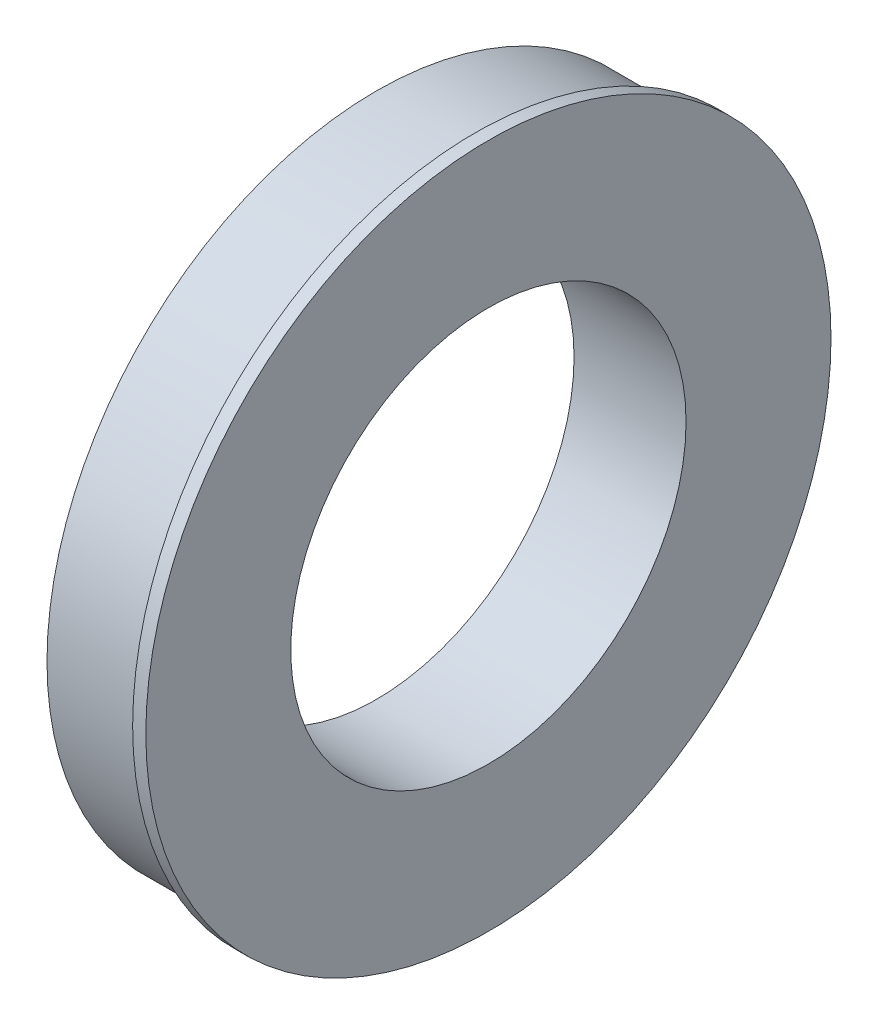
ISO-10303-21;
HEADER;
FILE_DESCRIPTION(('STEP AP214'),'2;1');
FILE_NAME('part.step','',(''),(''),'','','');
FILE_SCHEMA(('AUTOMOTIVE_DESIGN { 1 0 10303 214 1 1 1 1 }'));
ENDSEC;
DATA;
#1=APPLICATION_CONTEXT('core data for automotive mechanical design processes');
#2=APPLICATION_PROTOCOL_DEFINITION('international standard','automotive_design',2000,#1);
#3=PRODUCT_CONTEXT('',#1,'mechanical');
#4=PRODUCT('Part','Part','',(#3));
#5=PRODUCT_RELATED_PRODUCT_CATEGORY('part','',(#4));
#6=PRODUCT_DEFINITION_FORMATION('','',#4);
#7=PRODUCT_DEFINITION_CONTEXT('part definition',#1,'design');
#8=PRODUCT_DEFINITION('design','',#6,#7);
#9=PRODUCT_DEFINITION_SHAPE('','',#8);
#10=(LENGTH_UNIT() NAMED_UNIT(*) SI_UNIT(.MILLI.,.METRE.));
#11=(NAMED_UNIT(*) PLANE_ANGLE_UNIT() SI_UNIT($,.RADIAN.));
#12=(NAMED_UNIT(*) SI_UNIT($,.STERADIAN.) SOLID_ANGLE_UNIT());
#13=UNCERTAINTY_MEASURE_WITH_UNIT(LENGTH_MEASURE(1.E-05),#10,'distance_accuracy_value','');
#14=(GEOMETRIC_REPRESENTATION_CONTEXT(3) GLOBAL_UNCERTAINTY_ASSIGNED_CONTEXT((#13)) GLOBAL_UNIT_ASSIGNED_CONTEXT((#10,
#11,#12)) REPRESENTATION_CONTEXT('',''));
#15=CARTESIAN_POINT('',(0.,0.,0.));
#16=DIRECTION('',(0.,0.,1.));
#17=DIRECTION('',(1.,0.,0.));
#18=AXIS2_PLACEMENT_3D('',#15,#16,#17);
#19=CARTESIAN_POINT('',(0.,0.,0.));
#20=DIRECTION('',(1.,0.,0.));
#21=DIRECTION('',(0.,0.,-1.));
#22=AXIS2_PLACEMENT_3D('',#19,#20,#21);
#23=PLANE('',#22);
#24=CARTESIAN_POINT('',(0.,0.,0.));
#25=DIRECTION('',(1.,0.,0.));
#26=DIRECTION('',(0.,0.,-1.));
#27=AXIS2_PLACEMENT_3D('',#24,#25,#26);
#28=CIRCLE('',#27,63.5);
#29=CARTESIAN_POINT('',(0.,0.,-63.5));
#30=VERTEX_POINT('',#29);
#31=EDGE_CURVE('E34',#30,#30,#28,.T.);
#32=ORIENTED_EDGE('',*,*,#31,.F.);
#33=EDGE_LOOP('',(#32));
#34=FACE_BOUND('',#33,.T.);
#35=CARTESIAN_POINT('',(0.,0.,0.));
#36=DIRECTION('',(1.,0.,0.));
#37=DIRECTION('',(0.,0.,-1.));
#38=AXIS2_PLACEMENT_3D('',#35,#36,#37);
#39=CIRCLE('',#38,38.1);
#40=CARTESIAN_POINT('',(0.,0.,-38.1));
#41=VERTEX_POINT('',#40);
#42=EDGE_CURVE('E41',#41,#41,#39,.T.);
#43=ORIENTED_EDGE('',*,*,#42,.T.);
#44=EDGE_LOOP('',(#43));
#45=FACE_BOUND('',#44,.T.);
#46=ADVANCED_FACE('F30',(#34,#45),#23,.F.);
#47=CARTESIAN_POINT('',(19.05,0.,0.));
#48=DIRECTION('',(-1.,0.,0.));
#49=DIRECTION('',(0.,0.,1.));
#50=AXIS2_PLACEMENT_3D('',#47,#48,#49);
#51=CYLINDRICAL_SURFACE('',#50,63.5);
#52=CARTESIAN_POINT('',(19.05,0.,0.));
#53=DIRECTION('',(1.,0.,0.));
#54=DIRECTION('',(0.,0.,-1.));
#55=AXIS2_PLACEMENT_3D('',#52,#53,#54);
#56=CIRCLE('',#55,63.5);
#57=CARTESIAN_POINT('',(19.05,0.,-63.5));
#58=VERTEX_POINT('',#57);
#59=EDGE_CURVE('E10',#58,#58,#56,.T.);
#60=ORIENTED_EDGE('',*,*,#59,.F.);
#61=EDGE_LOOP('',(#60));
#62=FACE_BOUND('',#61,.T.);
#63=ORIENTED_EDGE('',*,*,#31,.T.);
#64=EDGE_LOOP('',(#63));
#65=FACE_BOUND('',#64,.T.);
#66=ADVANCED_FACE('F32',(#62,#65),#51,.T.);
#67=CARTESIAN_POINT('',(19.05,0.,0.));
#68=DIRECTION('',(-1.,0.,0.));
#69=DIRECTION('',(0.,0.,1.));
#70=AXIS2_PLACEMENT_3D('',#67,#68,#69);
#71=CYLINDRICAL_SURFACE('',#70,38.1);
#72=ORIENTED_EDGE('',*,*,#42,.F.);
#73=EDGE_LOOP('',(#72));
#74=FACE_BOUND('',#73,.T.);
#75=CARTESIAN_POINT('',(21.59,0.,0.));
#76=DIRECTION('',(1.,0.,0.));
#77=DIRECTION('',(0.,0.,-1.));
#78=AXIS2_PLACEMENT_3D('',#75,#76,#77);
#79=CIRCLE('',#78,38.1);
#80=CARTESIAN_POINT('',(21.59,0.,-38.1));
#81=VERTEX_POINT('',#80);
#82=EDGE_CURVE('E49',#81,#81,#79,.T.);
#83=ORIENTED_EDGE('',*,*,#82,.T.);
#84=EDGE_LOOP('',(#83));
#85=FACE_BOUND('',#84,.T.);
#86=ADVANCED_FACE('F55',(#74,#85),#71,.F.);
#87=CARTESIAN_POINT('',(19.05,0.,0.));
#88=DIRECTION('',(1.,0.,0.));
#89=DIRECTION('',(0.,0.,-1.));
#90=AXIS2_PLACEMENT_3D('',#87,#88,#89);
#91=PLANE('',#90);
#92=CARTESIAN_POINT('',(19.05,0.,0.));
#93=DIRECTION('',(1.,0.,0.));
#94=DIRECTION('',(0.,0.,-1.));
#95=AXIS2_PLACEMENT_3D('',#92,#93,#94);
#96=CIRCLE('',#95,66.04);
#97=CARTESIAN_POINT('',(19.05,0.,-66.04));
#98=VERTEX_POINT('',#97);
#99=EDGE_CURVE('E46',#98,#98,#96,.T.);
#100=ORIENTED_EDGE('',*,*,#99,.F.);
#101=EDGE_LOOP('',(#100));
#102=FACE_BOUND('',#101,.T.);
#103=ORIENTED_EDGE('',*,*,#59,.T.);
#104=EDGE_LOOP('',(#103));
#105=FACE_BOUND('',#104,.T.);
#106=ADVANCED_FACE('F60',(#102,#105),#91,.F.);
#107=CARTESIAN_POINT('',(21.59,0.,0.));
#108=DIRECTION('',(1.,0.,0.));
#109=DIRECTION('',(0.,0.,-1.));
#110=AXIS2_PLACEMENT_3D('',#107,#108,#109);
#111=PLANE('',#110);
#112=CARTESIAN_POINT('',(21.59,0.,0.));
#113=DIRECTION('',(1.,0.,0.));
#114=DIRECTION('',(0.,0.,-1.));
#115=AXIS2_PLACEMENT_3D('',#112,#113,#114);
#116=CIRCLE('',#115,66.04);
#117=CARTESIAN_POINT('',(21.59,0.,-66.04));
#118=VERTEX_POINT('',#117);
#119=EDGE_CURVE('E45',#118,#118,#116,.T.);
#120=ORIENTED_EDGE('',*,*,#119,.T.);
#121=EDGE_LOOP('',(#120));
#122=FACE_BOUND('',#121,.T.);
#123=ORIENTED_EDGE('',*,*,#82,.F.);
#124=EDGE_LOOP('',(#123));
#125=FACE_BOUND('',#124,.T.);
#126=ADVANCED_FACE('F57',(#122,#125),#111,.T.);
#127=CARTESIAN_POINT('',(21.59,0.,0.));
#128=DIRECTION('',(-1.,0.,0.));
#129=DIRECTION('',(0.,0.,1.));
#130=AXIS2_PLACEMENT_3D('',#127,#128,#129);
#131=CYLINDRICAL_SURFACE('',#130,66.04);
#132=ORIENTED_EDGE('',*,*,#119,.F.);
#133=EDGE_LOOP('',(#132));
#134=FACE_BOUND('',#133,.T.);
#135=ORIENTED_EDGE('',*,*,#99,.T.);
#136=EDGE_LOOP('',(#135));
#137=FACE_BOUND('',#136,.T.);
#138=ADVANCED_FACE('F59',(#134,#137),#131,.T.);
#139=CLOSED_SHELL('',(#46,#66,#86,#106,#126,#138));
#140=MANIFOLD_SOLID_BREP('B2',#139);
#141=ADVANCED_BREP_SHAPE_REPRESENTATION('',(#18,#140),#14);
#142=SHAPE_DEFINITION_REPRESENTATION(#9,#141);
ENDSEC;
END-ISO-10303-21;
